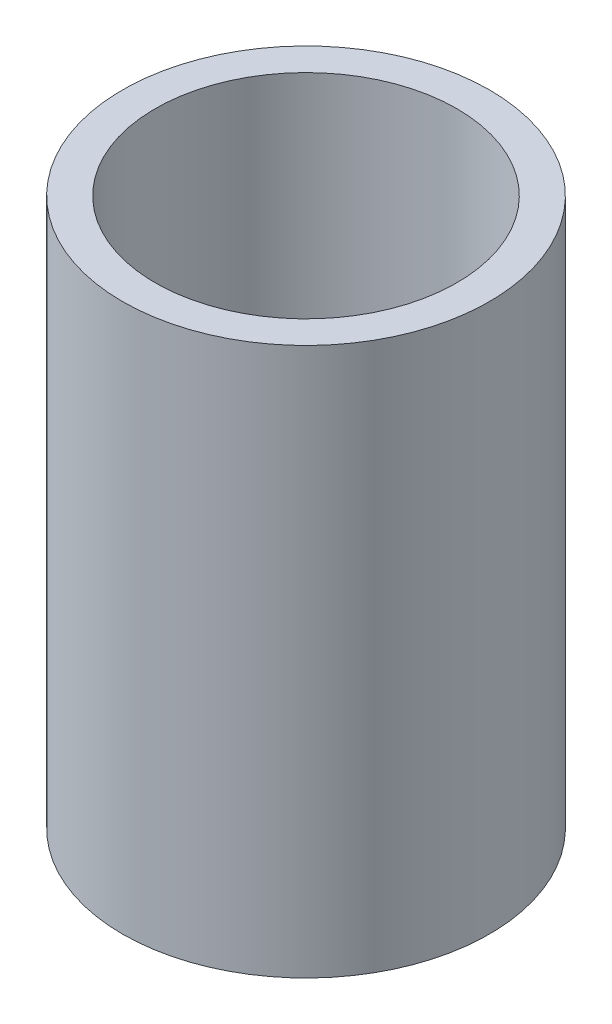
ISO-10303-21;
HEADER;
FILE_DESCRIPTION(('STEP AP214'),'2;1');
FILE_NAME('part.step','',(''),(''),'','','');
FILE_SCHEMA(('AUTOMOTIVE_DESIGN { 1 0 10303 214 1 1 1 1 }'));
ENDSEC;
DATA;
#1=APPLICATION_CONTEXT('core data for automotive mechanical design processes');
#2=APPLICATION_PROTOCOL_DEFINITION('international standard','automotive_design',2000,#1);
#3=PRODUCT_CONTEXT('',#1,'mechanical');
#4=PRODUCT('Part','Part','',(#3));
#5=PRODUCT_RELATED_PRODUCT_CATEGORY('part','',(#4));
#6=PRODUCT_DEFINITION_FORMATION('','',#4);
#7=PRODUCT_DEFINITION_CONTEXT('part definition',#1,'design');
#8=PRODUCT_DEFINITION('design','',#6,#7);
#9=PRODUCT_DEFINITION_SHAPE('','',#8);
#10=(LENGTH_UNIT() NAMED_UNIT(*) SI_UNIT(.MILLI.,.METRE.));
#11=(NAMED_UNIT(*) PLANE_ANGLE_UNIT() SI_UNIT($,.RADIAN.));
#12=(NAMED_UNIT(*) SI_UNIT($,.STERADIAN.) SOLID_ANGLE_UNIT());
#13=UNCERTAINTY_MEASURE_WITH_UNIT(LENGTH_MEASURE(1.E-05),#10,'distance_accuracy_value','');
#14=(GEOMETRIC_REPRESENTATION_CONTEXT(3) GLOBAL_UNCERTAINTY_ASSIGNED_CONTEXT((#13)) GLOBAL_UNIT_ASSIGNED_CONTEXT((#10,
#11,#12)) REPRESENTATION_CONTEXT('',''));
#15=CARTESIAN_POINT('',(0.,0.,0.));
#16=DIRECTION('',(0.,0.,1.));
#17=DIRECTION('',(1.,0.,0.));
#18=AXIS2_PLACEMENT_3D('',#15,#16,#17);
#19=CARTESIAN_POINT('',(0.,112.00456206429,0.));
#20=DIRECTION('',(0.,-1.,0.));
#21=DIRECTION('',(0.,0.,-1.));
#22=AXIS2_PLACEMENT_3D('',#19,#20,#21);
#23=CYLINDRICAL_SURFACE('',#22,37.5);
#24=CARTESIAN_POINT('',(0.,112.00456206429,0.));
#25=DIRECTION('',(0.,1.,0.));
#26=DIRECTION('',(0.,0.,1.));
#27=AXIS2_PLACEMENT_3D('',#24,#25,#26);
#28=CIRCLE('',#27,37.5);
#29=CARTESIAN_POINT('',(0.,112.00456206429,-37.5));
#30=VERTEX_POINT('',#29);
#31=EDGE_CURVE('E10',#30,#30,#28,.T.);
#32=CARTESIAN_POINT('',(0.,0.,0.));
#33=DIRECTION('',(0.,1.,0.));
#34=DIRECTION('',(0.,0.,1.));
#35=AXIS2_PLACEMENT_3D('',#32,#33,#34);
#36=CIRCLE('',#35,37.5);
#37=CARTESIAN_POINT('',(0.,0.,-37.5));
#38=VERTEX_POINT('',#37);
#39=EDGE_CURVE('E37',#38,#38,#36,.T.);
#40=CARTESIAN_POINT('',(0.,112.00456206429,-37.5));
#41=CARTESIAN_POINT('',(0.,110.83784787612,-37.5));
#42=CARTESIAN_POINT('',(0.,109.67113368795,-37.5));
#43=CARTESIAN_POINT('',(0.,107.337705311611,-37.5));
#44=CARTESIAN_POINT('',(0.,106.170991123441,-37.5));
#45=CARTESIAN_POINT('',(0.,103.837562747102,-37.5));
#46=CARTESIAN_POINT('',(0.,102.670848558932,-37.5));
#47=CARTESIAN_POINT('',(0.,100.337420182593,-37.5));
#48=CARTESIAN_POINT('',(0.,99.170705994423,-37.5));
#49=CARTESIAN_POINT('',(0.,96.8372776180837,-37.5));
#50=CARTESIAN_POINT('',(0.,95.670563429914,-37.5));
#51=CARTESIAN_POINT('',(0.,93.3371350535746,-37.5));
#52=CARTESIAN_POINT('',(0.,92.1704208654049,-37.5));
#53=CARTESIAN_POINT('',(0.,89.8369924890656,-37.5));
#54=CARTESIAN_POINT('',(0.,88.6702783008959,-37.5));
#55=CARTESIAN_POINT('',(0.,86.3368499245565,-37.5));
#56=CARTESIAN_POINT('',(0.,85.1701357363869,-37.5));
#57=CARTESIAN_POINT('',(0.,82.8367073600475,-37.5));
#58=CARTESIAN_POINT('',(0.,81.6699931718778,-37.5));
#59=CARTESIAN_POINT('',(0.,79.3365647955384,-37.5));
#60=CARTESIAN_POINT('',(0.,78.1698506073688,-37.5));
#61=CARTESIAN_POINT('',(0.,75.8364222310294,-37.5));
#62=CARTESIAN_POINT('',(0.,74.6697080428597,-37.5));
#63=CARTESIAN_POINT('',(0.,72.3362796665203,-37.5));
#64=CARTESIAN_POINT('',(0.,71.1695654783506,-37.5));
#65=CARTESIAN_POINT('',(0.,68.8361371020113,-37.5));
#66=CARTESIAN_POINT('',(0.,67.6694229138416,-37.5));
#67=CARTESIAN_POINT('',(0.,65.3359945375022,-37.5));
#68=CARTESIAN_POINT('',(0.,64.1692803493326,-37.5));
#69=CARTESIAN_POINT('',(0.,61.8358519729932,-37.5));
#70=CARTESIAN_POINT('',(0.,60.6691377848235,-37.5));
#71=CARTESIAN_POINT('',(0.,58.3357094084841,-37.5));
#72=CARTESIAN_POINT('',(0.,57.1689952203145,-37.5));
#73=CARTESIAN_POINT('',(0.,54.8355668439751,-37.5));
#74=CARTESIAN_POINT('',(0.,53.6688526558054,-37.5));
#75=CARTESIAN_POINT('',(0.,51.335424279466,-37.5));
#76=CARTESIAN_POINT('',(0.,50.1687100912964,-37.5));
#77=CARTESIAN_POINT('',(0.,47.835281714957,-37.5));
#78=CARTESIAN_POINT('',(0.,46.6685675267873,-37.5));
#79=CARTESIAN_POINT('',(0.,44.335139150448,-37.5));
#80=CARTESIAN_POINT('',(0.,43.1684249622783,-37.5));
#81=CARTESIAN_POINT('',(0.,40.8349965859389,-37.5));
#82=CARTESIAN_POINT('',(0.,39.6682823977692,-37.5));
#83=CARTESIAN_POINT('',(0.,37.3348540214299,-37.5));
#84=CARTESIAN_POINT('',(0.,36.1681398332602,-37.5));
#85=CARTESIAN_POINT('',(0.,33.8347114569208,-37.5));
#86=CARTESIAN_POINT('',(0.,32.6679972687511,-37.5));
#87=CARTESIAN_POINT('',(0.,30.3345688924118,-37.5));
#88=CARTESIAN_POINT('',(0.,29.1678547042421,-37.5));
#89=CARTESIAN_POINT('',(0.,26.8344263279027,-37.5));
#90=CARTESIAN_POINT('',(0.,25.667712139733,-37.5));
#91=CARTESIAN_POINT('',(0.,23.3342837633937,-37.5));
#92=CARTESIAN_POINT('',(0.,22.167569575224,-37.5));
#93=CARTESIAN_POINT('',(0.,19.8341411988846,-37.5));
#94=CARTESIAN_POINT('',(0.,18.6674270107149,-37.5));
#95=CARTESIAN_POINT('',(0.,16.3339986343756,-37.5));
#96=CARTESIAN_POINT('',(0.,15.1672844462059,-37.5));
#97=CARTESIAN_POINT('',(0.,12.8338560698665,-37.5));
#98=CARTESIAN_POINT('',(0.,11.6671418816968,-37.5));
#99=CARTESIAN_POINT('',(0.,9.33371350535746,-37.5));
#100=CARTESIAN_POINT('',(0.,8.16699931718778,-37.5));
#101=CARTESIAN_POINT('',(0.,5.83357094084841,-37.5));
#102=CARTESIAN_POINT('',(0.,4.66685675267873,-37.5));
#103=CARTESIAN_POINT('',(0.,2.33342837633937,-37.5));
#104=CARTESIAN_POINT('',(0.,1.16671418816968,-37.5));
#105=CARTESIAN_POINT('',(0.,0.,-37.5));
#106=B_SPLINE_CURVE_WITH_KNOTS('',3,(#40,#41,#42,#43,#44,#45,#46,#47,#48,#49,#50,#51,#52,#53,
#54,#55,#56,#57,#58,#59,#60,#61,#62,#63,#64,#65,#66,#67,#68,#69,#70,#71,#72,#73,#74,#75,#76,#77,
#78,#79,#80,#81,#82,#83,#84,#85,#86,#87,#88,#89,#90,#91,#92,#93,#94,#95,#96,#97,#98,#99,#100,
#101,#102,#103,#104,#105),.UNSPECIFIED.,.F.,.F.,(4,2,2,2,2,2,2,2,2,2,2,2,2,2,2,2,2,2,2,2,2,2,2,
2,2,2,2,2,2,2,2,2,4),(0.,3.50014256450906,7.00028512901811,10.5004276935272,14.0005702580362,
17.5007128225452,21.0008553870543,24.5009979515634,28.0011405160724,31.5012830805814,
35.0014256450905,38.5015682095995,42.0017107741086,45.5018533386176,49.0019959031267,
52.5021384676357,56.0022810321448,59.5024235966538,63.0025661611629,66.5027087256719,
70.002851290181,73.50299385469,77.0031364191991,80.5032789837081,84.0034215482172,
87.5035641127262,91.0037066772353,94.5038492417443,98.0039918062534,101.504134370762,
105.004276935271,108.504419499781,112.00456206429),.UNSPECIFIED.);
#107=EDGE_CURVE('BSEAM40',#30,#38,#106,.T.);
#108=ORIENTED_EDGE('',*,*,#31,.F.);
#109=ORIENTED_EDGE('',*,*,#39,.T.);
#110=ORIENTED_EDGE('',*,*,#107,.T.);
#111=ORIENTED_EDGE('',*,*,#107,.F.);
#112=EDGE_LOOP('',(#108,#110,#109,#111));
#113=FACE_BOUND('',#112,.T.);
#114=ADVANCED_FACE('F40',(#113),#23,.T.);
#115=CARTESIAN_POINT('',(0.,112.00456206429,0.));
#116=DIRECTION('',(0.,1.,0.));
#117=DIRECTION('',(0.,0.,1.));
#118=AXIS2_PLACEMENT_3D('',#115,#116,#117);
#119=PLANE('',#118);
#120=CARTESIAN_POINT('',(0.,112.00456206429,0.));
#121=DIRECTION('',(0.,1.,0.));
#122=DIRECTION('',(0.,0.,1.));
#123=AXIS2_PLACEMENT_3D('',#120,#121,#122);
#124=CIRCLE('',#123,30.8411816442855);
#125=CARTESIAN_POINT('',(0.,112.00456206429,-30.8411816442855));
#126=VERTEX_POINT('',#125);
#127=EDGE_CURVE('E50',#126,#126,#124,.T.);
#128=ORIENTED_EDGE('',*,*,#127,.F.);
#129=EDGE_LOOP('',(#128));
#130=FACE_BOUND('',#129,.T.);
#131=ORIENTED_EDGE('',*,*,#31,.T.);
#132=EDGE_LOOP('',(#131));
#133=FACE_BOUND('',#132,.T.);
#134=ADVANCED_FACE('F59',(#130,#133),#119,.T.);
#135=CARTESIAN_POINT('',(0.,0.,0.));
#136=DIRECTION('',(0.,1.,0.));
#137=DIRECTION('',(0.,0.,1.));
#138=AXIS2_PLACEMENT_3D('',#135,#136,#137);
#139=PLANE('',#138);
#140=CARTESIAN_POINT('',(0.,0.,0.));
#141=DIRECTION('',(0.,1.,0.));
#142=DIRECTION('',(0.,0.,1.));
#143=AXIS2_PLACEMENT_3D('',#140,#141,#142);
#144=CIRCLE('',#143,30.8411816442855);
#145=CARTESIAN_POINT('',(0.,0.,-30.8411816442855));
#146=VERTEX_POINT('',#145);
#147=EDGE_CURVE('E47',#146,#146,#144,.T.);
#148=ORIENTED_EDGE('',*,*,#147,.T.);
#149=EDGE_LOOP('',(#148));
#150=FACE_BOUND('',#149,.T.);
#151=ORIENTED_EDGE('',*,*,#39,.F.);
#152=EDGE_LOOP('',(#151));
#153=FACE_BOUND('',#152,.T.);
#154=ADVANCED_FACE('F58',(#150,#153),#139,.F.);
#155=CARTESIAN_POINT('',(0.,112.00456206429,0.));
#156=DIRECTION('',(0.,-1.,0.));
#157=DIRECTION('',(0.,0.,-1.));
#158=AXIS2_PLACEMENT_3D('',#155,#156,#157);
#159=CYLINDRICAL_SURFACE('',#158,30.8411816442855);
#160=CARTESIAN_POINT('',(0.,112.00456206429,-30.8411816442855));
#161=CARTESIAN_POINT('',(0.,110.83784787612,-30.8411816442855));
#162=CARTESIAN_POINT('',(0.,109.67113368795,-30.8411816442855));
#163=CARTESIAN_POINT('',(0.,107.337705311611,-30.8411816442855));
#164=CARTESIAN_POINT('',(0.,106.170991123441,-30.8411816442855));
#165=CARTESIAN_POINT('',(0.,103.837562747102,-30.8411816442855));
#166=CARTESIAN_POINT('',(0.,102.670848558932,-30.8411816442855));
#167=CARTESIAN_POINT('',(0.,100.337420182593,-30.8411816442855));
#168=CARTESIAN_POINT('',(0.,99.170705994423,-30.8411816442855));
#169=CARTESIAN_POINT('',(0.,96.8372776180837,-30.8411816442855));
#170=CARTESIAN_POINT('',(0.,95.670563429914,-30.8411816442855));
#171=CARTESIAN_POINT('',(0.,93.3371350535746,-30.8411816442855));
#172=CARTESIAN_POINT('',(0.,92.1704208654049,-30.8411816442855));
#173=CARTESIAN_POINT('',(0.,89.8369924890656,-30.8411816442855));
#174=CARTESIAN_POINT('',(0.,88.6702783008959,-30.8411816442855));
#175=CARTESIAN_POINT('',(0.,86.3368499245565,-30.8411816442855));
#176=CARTESIAN_POINT('',(0.,85.1701357363869,-30.8411816442855));
#177=CARTESIAN_POINT('',(0.,82.8367073600475,-30.8411816442855));
#178=CARTESIAN_POINT('',(0.,81.6699931718778,-30.8411816442855));
#179=CARTESIAN_POINT('',(0.,79.3365647955384,-30.8411816442855));
#180=CARTESIAN_POINT('',(0.,78.1698506073688,-30.8411816442855));
#181=CARTESIAN_POINT('',(0.,75.8364222310294,-30.8411816442855));
#182=CARTESIAN_POINT('',(0.,74.6697080428597,-30.8411816442855));
#183=CARTESIAN_POINT('',(0.,72.3362796665203,-30.8411816442855));
#184=CARTESIAN_POINT('',(0.,71.1695654783506,-30.8411816442855));
#185=CARTESIAN_POINT('',(0.,68.8361371020113,-30.8411816442855));
#186=CARTESIAN_POINT('',(0.,67.6694229138416,-30.8411816442855));
#187=CARTESIAN_POINT('',(0.,65.3359945375022,-30.8411816442855));
#188=CARTESIAN_POINT('',(0.,64.1692803493326,-30.8411816442855));
#189=CARTESIAN_POINT('',(0.,61.8358519729932,-30.8411816442855));
#190=CARTESIAN_POINT('',(0.,60.6691377848235,-30.8411816442855));
#191=CARTESIAN_POINT('',(0.,58.3357094084841,-30.8411816442855));
#192=CARTESIAN_POINT('',(0.,57.1689952203145,-30.8411816442855));
#193=CARTESIAN_POINT('',(0.,54.8355668439751,-30.8411816442855));
#194=CARTESIAN_POINT('',(0.,53.6688526558054,-30.8411816442855));
#195=CARTESIAN_POINT('',(0.,51.335424279466,-30.8411816442855));
#196=CARTESIAN_POINT('',(0.,50.1687100912964,-30.8411816442855));
#197=CARTESIAN_POINT('',(0.,47.835281714957,-30.8411816442855));
#198=CARTESIAN_POINT('',(0.,46.6685675267873,-30.8411816442855));
#199=CARTESIAN_POINT('',(0.,44.335139150448,-30.8411816442855));
#200=CARTESIAN_POINT('',(0.,43.1684249622783,-30.8411816442855));
#201=CARTESIAN_POINT('',(0.,40.8349965859389,-30.8411816442855));
#202=CARTESIAN_POINT('',(0.,39.6682823977692,-30.8411816442855));
#203=CARTESIAN_POINT('',(0.,37.3348540214299,-30.8411816442855));
#204=CARTESIAN_POINT('',(0.,36.1681398332602,-30.8411816442855));
#205=CARTESIAN_POINT('',(0.,33.8347114569208,-30.8411816442855));
#206=CARTESIAN_POINT('',(0.,32.6679972687511,-30.8411816442855));
#207=CARTESIAN_POINT('',(0.,30.3345688924118,-30.8411816442855));
#208=CARTESIAN_POINT('',(0.,29.1678547042421,-30.8411816442855));
#209=CARTESIAN_POINT('',(0.,26.8344263279027,-30.8411816442855));
#210=CARTESIAN_POINT('',(0.,25.667712139733,-30.8411816442855));
#211=CARTESIAN_POINT('',(0.,23.3342837633937,-30.8411816442855));
#212=CARTESIAN_POINT('',(0.,22.167569575224,-30.8411816442855));
#213=CARTESIAN_POINT('',(0.,19.8341411988846,-30.8411816442855));
#214=CARTESIAN_POINT('',(0.,18.6674270107149,-30.8411816442855));
#215=CARTESIAN_POINT('',(0.,16.3339986343756,-30.8411816442855));
#216=CARTESIAN_POINT('',(0.,15.1672844462059,-30.8411816442855));
#217=CARTESIAN_POINT('',(0.,12.8338560698665,-30.8411816442855));
#218=CARTESIAN_POINT('',(0.,11.6671418816968,-30.8411816442855));
#219=CARTESIAN_POINT('',(0.,9.33371350535746,-30.8411816442855));
#220=CARTESIAN_POINT('',(0.,8.16699931718778,-30.8411816442855));
#221=CARTESIAN_POINT('',(0.,5.83357094084841,-30.8411816442855));
#222=CARTESIAN_POINT('',(0.,4.66685675267873,-30.8411816442855));
#223=CARTESIAN_POINT('',(0.,2.33342837633937,-30.8411816442855));
#224=CARTESIAN_POINT('',(0.,1.16671418816968,-30.8411816442855));
#225=CARTESIAN_POINT('',(0.,0.,-30.8411816442855));
#226=B_SPLINE_CURVE_WITH_KNOTS('',3,(#160,#161,#162,#163,#164,#165,#166,#167,#168,#169,#170,
#171,#172,#173,#174,#175,#176,#177,#178,#179,#180,#181,#182,#183,#184,#185,#186,#187,#188,#189,
#190,#191,#192,#193,#194,#195,#196,#197,#198,#199,#200,#201,#202,#203,#204,#205,#206,#207,#208,
#209,#210,#211,#212,#213,#214,#215,#216,#217,#218,#219,#220,#221,#222,#223,#224,#225),
.UNSPECIFIED.,.F.,.F.,(4,2,2,2,2,2,2,2,2,2,2,2,2,2,2,2,2,2,2,2,2,2,2,2,2,2,2,2,2,2,2,2,4),(0.,
3.50014256450906,7.00028512901811,10.5004276935272,14.0005702580362,17.5007128225452,
21.0008553870543,24.5009979515634,28.0011405160724,31.5012830805814,35.0014256450905,
38.5015682095995,42.0017107741086,45.5018533386176,49.0019959031267,52.5021384676357,
56.0022810321448,59.5024235966538,63.0025661611629,66.5027087256719,70.002851290181,
73.50299385469,77.0031364191991,80.5032789837081,84.0034215482172,87.5035641127262,
91.0037066772353,94.5038492417443,98.0039918062534,101.504134370762,105.004276935271,
108.504419499781,112.00456206429),.UNSPECIFIED.);
#227=EDGE_CURVE('BSEAM54',#126,#146,#226,.T.);
#228=ORIENTED_EDGE('',*,*,#127,.T.);
#229=ORIENTED_EDGE('',*,*,#147,.F.);
#230=ORIENTED_EDGE('',*,*,#227,.T.);
#231=ORIENTED_EDGE('',*,*,#227,.F.);
#232=EDGE_LOOP('',(#228,#230,#229,#231));
#233=FACE_BOUND('',#232,.T.);
#234=ADVANCED_FACE('F54',(#233),#159,.F.);
#235=CLOSED_SHELL('',(#114,#134,#154,#234));
#236=MANIFOLD_SOLID_BREP('B2',#235);
#237=ADVANCED_BREP_SHAPE_REPRESENTATION('',(#18,#236),#14);
#238=SHAPE_DEFINITION_REPRESENTATION(#9,#237);
ENDSEC;
END-ISO-10303-21;
